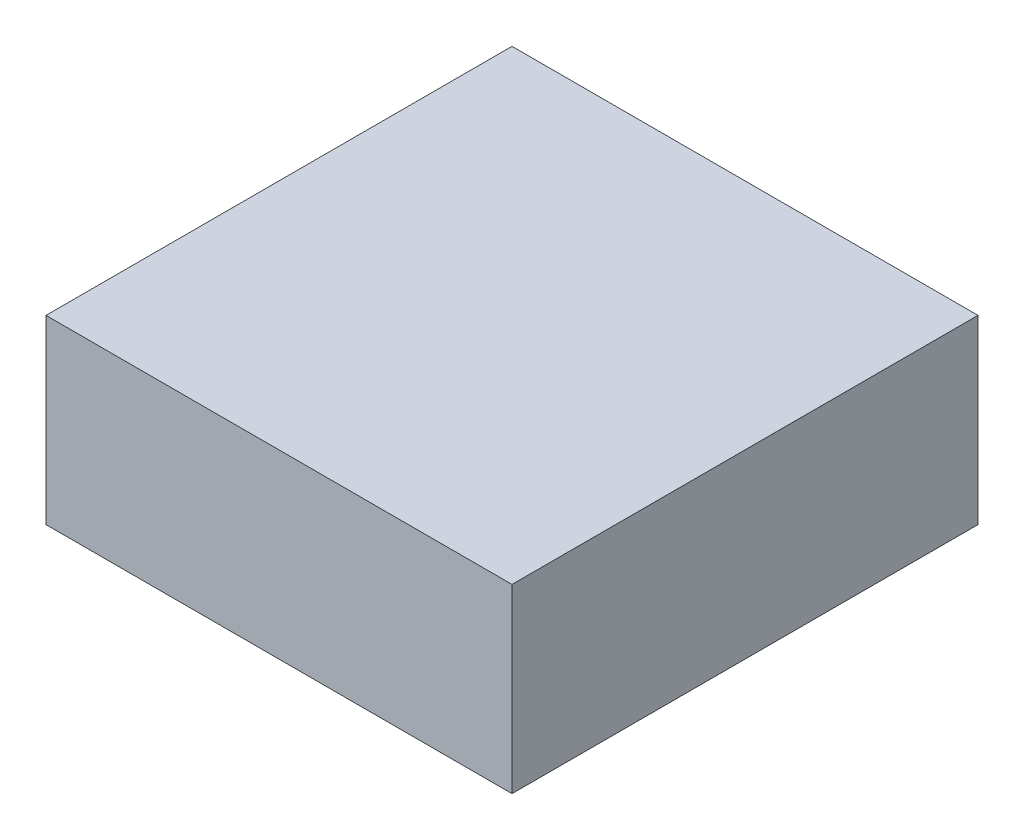
ISO-10303-21;
HEADER;
FILE_DESCRIPTION(('STEP AP214'),'2;1');
FILE_NAME('part.step','',(''),(''),'','','');
FILE_SCHEMA(('AUTOMOTIVE_DESIGN { 1 0 10303 214 1 1 1 1 }'));
ENDSEC;
DATA;
#1=APPLICATION_CONTEXT('core data for automotive mechanical design processes');
#2=APPLICATION_PROTOCOL_DEFINITION('international standard','automotive_design',2000,#1);
#3=PRODUCT_CONTEXT('',#1,'mechanical');
#4=PRODUCT('Part','Part','',(#3));
#5=PRODUCT_RELATED_PRODUCT_CATEGORY('part','',(#4));
#6=PRODUCT_DEFINITION_FORMATION('','',#4);
#7=PRODUCT_DEFINITION_CONTEXT('part definition',#1,'design');
#8=PRODUCT_DEFINITION('design','',#6,#7);
#9=PRODUCT_DEFINITION_SHAPE('','',#8);
#10=(LENGTH_UNIT() NAMED_UNIT(*) SI_UNIT(.MILLI.,.METRE.));
#11=(NAMED_UNIT(*) PLANE_ANGLE_UNIT() SI_UNIT($,.RADIAN.));
#12=(NAMED_UNIT(*) SI_UNIT($,.STERADIAN.) SOLID_ANGLE_UNIT());
#13=UNCERTAINTY_MEASURE_WITH_UNIT(LENGTH_MEASURE(1.E-05),#10,'distance_accuracy_value','');
#14=(GEOMETRIC_REPRESENTATION_CONTEXT(3) GLOBAL_UNCERTAINTY_ASSIGNED_CONTEXT((#13)) GLOBAL_UNIT_ASSIGNED_CONTEXT((#10,
#11,#12)) REPRESENTATION_CONTEXT('',''));
#15=CARTESIAN_POINT('',(0.,0.,0.));
#16=DIRECTION('',(0.,0.,1.));
#17=DIRECTION('',(1.,0.,0.));
#18=AXIS2_PLACEMENT_3D('',#15,#16,#17);
#19=CARTESIAN_POINT('',(-0.4499991,0.17500092,0.));
#20=DIRECTION('',(0.,1.,0.));
#21=DIRECTION('',(0.,0.,1.));
#22=AXIS2_PLACEMENT_3D('',#19,#20,#21);
#23=PLANE('',#22);
#24=DIRECTION('',(0.,0.,-1.));
#25=VECTOR('',#24,1.);
#26=CARTESIAN_POINT('',(0.4499991,0.17500092,0.));
#27=LINE('',#26,#25);
#28=CARTESIAN_POINT('',(0.4499991,0.17500092,0.));
#29=VERTEX_POINT('',#28);
#30=CARTESIAN_POINT('',(0.4499991,0.17500092,0.90000074));
#31=VERTEX_POINT('',#30);
#32=EDGE_CURVE('E20',#29,#31,#27,.F.);
#33=ORIENTED_EDGE('',*,*,#32,.F.);
#34=DIRECTION('',(1.,0.,0.));
#35=VECTOR('',#34,1.);
#36=CARTESIAN_POINT('',(0.4499991,0.17500092,0.));
#37=LINE('',#36,#35);
#38=CARTESIAN_POINT('',(-0.4499991,0.17500092,0.));
#39=VERTEX_POINT('',#38);
#40=EDGE_CURVE('E80',#29,#39,#37,.F.);
#41=ORIENTED_EDGE('',*,*,#40,.T.);
#42=DIRECTION('',(0.,0.,1.));
#43=VECTOR('',#42,1.);
#44=CARTESIAN_POINT('',(-0.4499991,0.17500092,0.));
#45=LINE('',#44,#43);
#46=CARTESIAN_POINT('',(-0.4499991,0.17500092,0.90000074));
#47=VERTEX_POINT('',#46);
#48=EDGE_CURVE('E68',#47,#39,#45,.F.);
#49=ORIENTED_EDGE('',*,*,#48,.F.);
#50=DIRECTION('',(1.,0.,0.));
#51=VECTOR('',#50,1.);
#52=CARTESIAN_POINT('',(0.4499991,0.17500092,0.90000074));
#53=LINE('',#52,#51);
#54=EDGE_CURVE('E56',#31,#47,#53,.F.);
#55=ORIENTED_EDGE('',*,*,#54,.F.);
#56=EDGE_LOOP('',(#33,#41,#49,#55));
#57=FACE_BOUND('',#56,.T.);
#58=ADVANCED_FACE('F17',(#57),#23,.T.);
#59=CARTESIAN_POINT('',(0.4499991,0.17500092,0.));
#60=DIRECTION('',(1.,0.,0.));
#61=DIRECTION('',(0.,0.,-1.));
#62=AXIS2_PLACEMENT_3D('',#59,#60,#61);
#63=PLANE('',#62);
#64=DIRECTION('',(0.,0.,-1.));
#65=VECTOR('',#64,1.);
#66=CARTESIAN_POINT('',(0.4499991,-0.17500092,0.));
#67=LINE('',#66,#65);
#68=CARTESIAN_POINT('',(0.4499991,-0.17500092,0.));
#69=VERTEX_POINT('',#68);
#70=CARTESIAN_POINT('',(0.4499991,-0.17500092,0.90000074));
#71=VERTEX_POINT('',#70);
#72=EDGE_CURVE('E83',#69,#71,#67,.F.);
#73=ORIENTED_EDGE('',*,*,#72,.F.);
#74=DIRECTION('',(0.,1.,0.));
#75=VECTOR('',#74,1.);
#76=CARTESIAN_POINT('',(0.4499991,-0.17500092,0.));
#77=LINE('',#76,#75);
#78=EDGE_CURVE('E65',#69,#29,#77,.T.);
#79=ORIENTED_EDGE('',*,*,#78,.T.);
#80=ORIENTED_EDGE('',*,*,#32,.T.);
#81=DIRECTION('',(0.,1.,0.));
#82=VECTOR('',#81,1.);
#83=CARTESIAN_POINT('',(0.4499991,-0.17500092,0.90000074));
#84=LINE('',#83,#82);
#85=EDGE_CURVE('E62',#71,#31,#84,.T.);
#86=ORIENTED_EDGE('',*,*,#85,.F.);
#87=EDGE_LOOP('',(#73,#79,#80,#86));
#88=FACE_BOUND('',#87,.T.);
#89=ADVANCED_FACE('F61',(#88),#63,.T.);
#90=CARTESIAN_POINT('',(0.4499991,-0.17500092,0.90000074));
#91=DIRECTION('',(0.,0.,1.));
#92=DIRECTION('',(1.,0.,0.));
#93=AXIS2_PLACEMENT_3D('',#90,#91,#92);
#94=PLANE('',#93);
#95=DIRECTION('',(0.,1.,0.));
#96=VECTOR('',#95,1.);
#97=CARTESIAN_POINT('',(-0.4499991,-0.17500092,0.90000074));
#98=LINE('',#97,#96);
#99=CARTESIAN_POINT('',(-0.4499991,-0.17500092,0.90000074));
#100=VERTEX_POINT('',#99);
#101=EDGE_CURVE('E70',#100,#47,#98,.T.);
#102=ORIENTED_EDGE('',*,*,#101,.F.);
#103=DIRECTION('',(1.,0.,0.));
#104=VECTOR('',#103,1.);
#105=CARTESIAN_POINT('',(0.4499991,-0.17500092,0.90000074));
#106=LINE('',#105,#104);
#107=EDGE_CURVE('E74',#71,#100,#106,.F.);
#108=ORIENTED_EDGE('',*,*,#107,.F.);
#109=ORIENTED_EDGE('',*,*,#85,.T.);
#110=ORIENTED_EDGE('',*,*,#54,.T.);
#111=EDGE_LOOP('',(#102,#108,#109,#110));
#112=FACE_BOUND('',#111,.T.);
#113=ADVANCED_FACE('F72',(#112),#94,.T.);
#114=CARTESIAN_POINT('',(-0.4499991,-0.17500092,0.));
#115=DIRECTION('',(-1.,0.,0.));
#116=DIRECTION('',(0.,0.,1.));
#117=AXIS2_PLACEMENT_3D('',#114,#115,#116);
#118=PLANE('',#117);
#119=ORIENTED_EDGE('',*,*,#48,.T.);
#120=DIRECTION('',(0.,1.,0.));
#121=VECTOR('',#120,1.);
#122=CARTESIAN_POINT('',(-0.4499991,-0.17500092,0.));
#123=LINE('',#122,#121);
#124=CARTESIAN_POINT('',(-0.4499991,-0.17500092,0.));
#125=VERTEX_POINT('',#124);
#126=EDGE_CURVE('E35',#39,#125,#123,.F.);
#127=ORIENTED_EDGE('',*,*,#126,.T.);
#128=DIRECTION('',(0.,0.,-1.));
#129=VECTOR('',#128,1.);
#130=CARTESIAN_POINT('',(-0.4499991,-0.17500092,0.));
#131=LINE('',#130,#129);
#132=EDGE_CURVE('E26',#100,#125,#131,.T.);
#133=ORIENTED_EDGE('',*,*,#132,.F.);
#134=ORIENTED_EDGE('',*,*,#101,.T.);
#135=EDGE_LOOP('',(#119,#127,#133,#134));
#136=FACE_BOUND('',#135,.T.);
#137=ADVANCED_FACE('F89',(#136),#118,.T.);
#138=CARTESIAN_POINT('',(0.4499991,-0.17500092,0.));
#139=DIRECTION('',(0.,0.,1.));
#140=DIRECTION('',(1.,0.,0.));
#141=AXIS2_PLACEMENT_3D('',#138,#139,#140);
#142=PLANE('',#141);
#143=ORIENTED_EDGE('',*,*,#126,.F.);
#144=ORIENTED_EDGE('',*,*,#40,.F.);
#145=ORIENTED_EDGE('',*,*,#78,.F.);
#146=DIRECTION('',(1.,0.,0.));
#147=VECTOR('',#146,1.);
#148=CARTESIAN_POINT('',(0.4499991,-0.17500092,0.));
#149=LINE('',#148,#147);
#150=EDGE_CURVE('E11',#125,#69,#149,.T.);
#151=ORIENTED_EDGE('',*,*,#150,.F.);
#152=EDGE_LOOP('',(#143,#144,#145,#151));
#153=FACE_BOUND('',#152,.T.);
#154=ADVANCED_FACE('F91',(#153),#142,.F.);
#155=CARTESIAN_POINT('',(0.4499991,-0.17500092,0.));
#156=DIRECTION('',(0.,-1.,0.));
#157=DIRECTION('',(0.,0.,-1.));
#158=AXIS2_PLACEMENT_3D('',#155,#156,#157);
#159=PLANE('',#158);
#160=ORIENTED_EDGE('',*,*,#132,.T.);
#161=ORIENTED_EDGE('',*,*,#150,.T.);
#162=ORIENTED_EDGE('',*,*,#72,.T.);
#163=ORIENTED_EDGE('',*,*,#107,.T.);
#164=EDGE_LOOP('',(#160,#161,#162,#163));
#165=FACE_BOUND('',#164,.T.);
#166=ADVANCED_FACE('F88',(#165),#159,.T.);
#167=CLOSED_SHELL('',(#58,#89,#113,#137,#154,#166));
#168=MANIFOLD_SOLID_BREP('B1',#167);
#169=ADVANCED_BREP_SHAPE_REPRESENTATION('',(#18,#168),#14);
#170=SHAPE_DEFINITION_REPRESENTATION(#9,#169);
ENDSEC;
END-ISO-10303-21;
